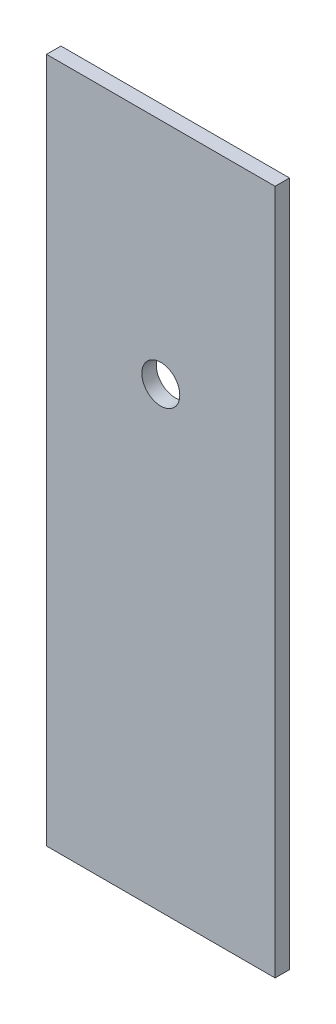
ISO-10303-21;
HEADER;
FILE_DESCRIPTION(('STEP AP214'),'2;1');
FILE_NAME('part.step','',(''),(''),'','','');
FILE_SCHEMA(('AUTOMOTIVE_DESIGN { 1 0 10303 214 1 1 1 1 }'));
ENDSEC;
DATA;
#1=APPLICATION_CONTEXT('core data for automotive mechanical design processes');
#2=APPLICATION_PROTOCOL_DEFINITION('international standard','automotive_design',2000,#1);
#3=PRODUCT_CONTEXT('',#1,'mechanical');
#4=PRODUCT('Part','Part','',(#3));
#5=PRODUCT_RELATED_PRODUCT_CATEGORY('part','',(#4));
#6=PRODUCT_DEFINITION_FORMATION('','',#4);
#7=PRODUCT_DEFINITION_CONTEXT('part definition',#1,'design');
#8=PRODUCT_DEFINITION('design','',#6,#7);
#9=PRODUCT_DEFINITION_SHAPE('','',#8);
#10=(LENGTH_UNIT() NAMED_UNIT(*) SI_UNIT(.MILLI.,.METRE.));
#11=(NAMED_UNIT(*) PLANE_ANGLE_UNIT() SI_UNIT($,.RADIAN.));
#12=(NAMED_UNIT(*) SI_UNIT($,.STERADIAN.) SOLID_ANGLE_UNIT());
#13=UNCERTAINTY_MEASURE_WITH_UNIT(LENGTH_MEASURE(1.E-05),#10,'distance_accuracy_value','');
#14=(GEOMETRIC_REPRESENTATION_CONTEXT(3) GLOBAL_UNCERTAINTY_ASSIGNED_CONTEXT((#13)) GLOBAL_UNIT_ASSIGNED_CONTEXT((#10,
#11,#12)) REPRESENTATION_CONTEXT('',''));
#15=CARTESIAN_POINT('',(0.,0.,0.));
#16=DIRECTION('',(0.,0.,1.));
#17=DIRECTION('',(1.,0.,0.));
#18=AXIS2_PLACEMENT_3D('',#15,#16,#17);
#19=CARTESIAN_POINT('',(12.7,38.1,1.6002));
#20=DIRECTION('',(-1.,0.,0.));
#21=DIRECTION('',(0.,-1.,0.));
#22=AXIS2_PLACEMENT_3D('',#19,#20,#21);
#23=PLANE('',#22);
#24=DIRECTION('',(0.,1.,0.));
#25=VECTOR('',#24,1.);
#26=CARTESIAN_POINT('',(12.7,38.1,0.));
#27=LINE('',#26,#25);
#28=CARTESIAN_POINT('',(12.7,-38.1,0.));
#29=VERTEX_POINT('',#28);
#30=CARTESIAN_POINT('',(12.7,38.1,0.));
#31=VERTEX_POINT('',#30);
#32=EDGE_CURVE('E94',#29,#31,#27,.T.);
#33=ORIENTED_EDGE('',*,*,#32,.T.);
#34=DIRECTION('',(0.,0.,-1.));
#35=VECTOR('',#34,1.);
#36=CARTESIAN_POINT('',(12.7,38.1,1.6002));
#37=LINE('',#36,#35);
#38=CARTESIAN_POINT('',(12.7,38.1,1.6002));
#39=VERTEX_POINT('',#38);
#40=EDGE_CURVE('E11',#39,#31,#37,.T.);
#41=ORIENTED_EDGE('',*,*,#40,.F.);
#42=DIRECTION('',(0.,1.,0.));
#43=VECTOR('',#42,1.);
#44=CARTESIAN_POINT('',(12.7,38.1,1.6002));
#45=LINE('',#44,#43);
#46=CARTESIAN_POINT('',(12.7,-38.1,1.6002));
#47=VERTEX_POINT('',#46);
#48=EDGE_CURVE('E82',#47,#39,#45,.T.);
#49=ORIENTED_EDGE('',*,*,#48,.F.);
#50=DIRECTION('',(0.,0.,-1.));
#51=VECTOR('',#50,1.);
#52=CARTESIAN_POINT('',(12.7,-38.1,1.6002));
#53=LINE('',#52,#51);
#54=EDGE_CURVE('E90',#47,#29,#53,.T.);
#55=ORIENTED_EDGE('',*,*,#54,.T.);
#56=EDGE_LOOP('',(#33,#41,#49,#55));
#57=FACE_BOUND('',#56,.T.);
#58=ADVANCED_FACE('F31',(#57),#23,.F.);
#59=CARTESIAN_POINT('',(-12.7,38.1,1.6002));
#60=DIRECTION('',(0.,-1.,0.));
#61=DIRECTION('',(0.,0.,-1.));
#62=AXIS2_PLACEMENT_3D('',#59,#60,#61);
#63=PLANE('',#62);
#64=DIRECTION('',(-1.,0.,0.));
#65=VECTOR('',#64,1.);
#66=CARTESIAN_POINT('',(-12.7,38.1,0.));
#67=LINE('',#66,#65);
#68=CARTESIAN_POINT('',(-12.7,38.1,0.));
#69=VERTEX_POINT('',#68);
#70=EDGE_CURVE('E86',#31,#69,#67,.T.);
#71=ORIENTED_EDGE('',*,*,#70,.T.);
#72=DIRECTION('',(0.,0.,-1.));
#73=VECTOR('',#72,1.);
#74=CARTESIAN_POINT('',(-12.7,38.1,1.6002));
#75=LINE('',#74,#73);
#76=CARTESIAN_POINT('',(-12.7,38.1,1.6002));
#77=VERTEX_POINT('',#76);
#78=EDGE_CURVE('E39',#77,#69,#75,.T.);
#79=ORIENTED_EDGE('',*,*,#78,.F.);
#80=DIRECTION('',(-1.,0.,0.));
#81=VECTOR('',#80,1.);
#82=CARTESIAN_POINT('',(-12.7,38.1,1.6002));
#83=LINE('',#82,#81);
#84=EDGE_CURVE('E77',#39,#77,#83,.T.);
#85=ORIENTED_EDGE('',*,*,#84,.F.);
#86=ORIENTED_EDGE('',*,*,#40,.T.);
#87=EDGE_LOOP('',(#71,#79,#85,#86));
#88=FACE_BOUND('',#87,.T.);
#89=ADVANCED_FACE('F85',(#88),#63,.F.);
#90=CARTESIAN_POINT('',(-12.7,38.1,1.6002));
#91=DIRECTION('',(1.,0.,0.));
#92=DIRECTION('',(0.,1.,0.));
#93=AXIS2_PLACEMENT_3D('',#90,#91,#92);
#94=PLANE('',#93);
#95=DIRECTION('',(0.,-1.,0.));
#96=VECTOR('',#95,1.);
#97=CARTESIAN_POINT('',(-12.7,38.1,0.));
#98=LINE('',#97,#96);
#99=CARTESIAN_POINT('',(-12.7,-38.1,0.));
#100=VERTEX_POINT('',#99);
#101=EDGE_CURVE('E64',#69,#100,#98,.T.);
#102=ORIENTED_EDGE('',*,*,#101,.T.);
#103=DIRECTION('',(0.,0.,-1.));
#104=VECTOR('',#103,1.);
#105=CARTESIAN_POINT('',(-12.7,-38.1,1.6002));
#106=LINE('',#105,#104);
#107=CARTESIAN_POINT('',(-12.7,-38.1,1.6002));
#108=VERTEX_POINT('',#107);
#109=EDGE_CURVE('E87',#108,#100,#106,.T.);
#110=ORIENTED_EDGE('',*,*,#109,.F.);
#111=DIRECTION('',(0.,-1.,0.));
#112=VECTOR('',#111,1.);
#113=CARTESIAN_POINT('',(-12.7,38.1,1.6002));
#114=LINE('',#113,#112);
#115=EDGE_CURVE('E80',#77,#108,#114,.T.);
#116=ORIENTED_EDGE('',*,*,#115,.F.);
#117=ORIENTED_EDGE('',*,*,#78,.T.);
#118=EDGE_LOOP('',(#102,#110,#116,#117));
#119=FACE_BOUND('',#118,.T.);
#120=ADVANCED_FACE('F88',(#119),#94,.F.);
#121=CARTESIAN_POINT('',(-12.7,-38.1,1.6002));
#122=DIRECTION('',(0.,1.,0.));
#123=DIRECTION('',(0.,0.,1.));
#124=AXIS2_PLACEMENT_3D('',#121,#122,#123);
#125=PLANE('',#124);
#126=DIRECTION('',(1.,0.,0.));
#127=VECTOR('',#126,1.);
#128=CARTESIAN_POINT('',(-12.7,-38.1,0.));
#129=LINE('',#128,#127);
#130=EDGE_CURVE('E70',#100,#29,#129,.T.);
#131=ORIENTED_EDGE('',*,*,#130,.T.);
#132=ORIENTED_EDGE('',*,*,#54,.F.);
#133=DIRECTION('',(1.,0.,0.));
#134=VECTOR('',#133,1.);
#135=CARTESIAN_POINT('',(-12.7,-38.1,1.6002));
#136=LINE('',#135,#134);
#137=EDGE_CURVE('E47',#108,#47,#136,.T.);
#138=ORIENTED_EDGE('',*,*,#137,.F.);
#139=ORIENTED_EDGE('',*,*,#109,.T.);
#140=EDGE_LOOP('',(#131,#132,#138,#139));
#141=FACE_BOUND('',#140,.T.);
#142=ADVANCED_FACE('F102',(#141),#125,.F.);
#143=CARTESIAN_POINT('',(12.7,-38.1,1.6002));
#144=DIRECTION('',(0.,0.,1.));
#145=DIRECTION('',(1.,0.,0.));
#146=AXIS2_PLACEMENT_3D('',#143,#144,#145);
#147=PLANE('',#146);
#148=CARTESIAN_POINT('',(0.,12.7,1.6002));
#149=DIRECTION('',(0.,0.,1.));
#150=DIRECTION('',(1.,0.,0.));
#151=AXIS2_PLACEMENT_3D('',#148,#149,#150);
#152=CIRCLE('',#151,2.1082);
#153=CARTESIAN_POINT('',(2.1082,12.7,1.6002));
#154=VERTEX_POINT('',#153);
#155=EDGE_CURVE('E108',#154,#154,#152,.T.);
#156=ORIENTED_EDGE('',*,*,#155,.F.);
#157=EDGE_LOOP('',(#156));
#158=FACE_BOUND('',#157,.T.);
#159=ORIENTED_EDGE('',*,*,#48,.T.);
#160=ORIENTED_EDGE('',*,*,#84,.T.);
#161=ORIENTED_EDGE('',*,*,#115,.T.);
#162=ORIENTED_EDGE('',*,*,#137,.T.);
#163=EDGE_LOOP('',(#159,#160,#161,#162));
#164=FACE_BOUND('',#163,.T.);
#165=ADVANCED_FACE('F78',(#158,#164),#147,.T.);
#166=CARTESIAN_POINT('',(12.7,-38.1,0.));
#167=DIRECTION('',(0.,0.,1.));
#168=DIRECTION('',(1.,0.,0.));
#169=AXIS2_PLACEMENT_3D('',#166,#167,#168);
#170=PLANE('',#169);
#171=CARTESIAN_POINT('',(0.,12.7,0.));
#172=DIRECTION('',(0.,0.,1.));
#173=DIRECTION('',(1.,0.,0.));
#174=AXIS2_PLACEMENT_3D('',#171,#172,#173);
#175=CIRCLE('',#174,2.1082);
#176=CARTESIAN_POINT('',(2.1082,12.7,0.));
#177=VERTEX_POINT('',#176);
#178=EDGE_CURVE('E97',#177,#177,#175,.T.);
#179=ORIENTED_EDGE('',*,*,#178,.T.);
#180=EDGE_LOOP('',(#179));
#181=FACE_BOUND('',#180,.T.);
#182=ORIENTED_EDGE('',*,*,#32,.F.);
#183=ORIENTED_EDGE('',*,*,#130,.F.);
#184=ORIENTED_EDGE('',*,*,#101,.F.);
#185=ORIENTED_EDGE('',*,*,#70,.F.);
#186=EDGE_LOOP('',(#182,#183,#184,#185));
#187=FACE_BOUND('',#186,.T.);
#188=ADVANCED_FACE('F105',(#181,#187),#170,.F.);
#189=CARTESIAN_POINT('',(0.,12.7,0.));
#190=DIRECTION('',(0.,0.,1.));
#191=DIRECTION('',(1.,0.,0.));
#192=AXIS2_PLACEMENT_3D('',#189,#190,#191);
#193=CYLINDRICAL_SURFACE('',#192,2.1082);
#194=ORIENTED_EDGE('',*,*,#178,.F.);
#195=EDGE_LOOP('',(#194));
#196=FACE_BOUND('',#195,.T.);
#197=ORIENTED_EDGE('',*,*,#155,.T.);
#198=EDGE_LOOP('',(#197));
#199=FACE_BOUND('',#198,.T.);
#200=ADVANCED_FACE('F115',(#196,#199),#193,.F.);
#201=CLOSED_SHELL('',(#58,#89,#120,#142,#165,#188,#200));
#202=MANIFOLD_SOLID_BREP('B2',#201);
#203=ADVANCED_BREP_SHAPE_REPRESENTATION('',(#18,#202),#14);
#204=SHAPE_DEFINITION_REPRESENTATION(#9,#203);
ENDSEC;
END-ISO-10303-21;
